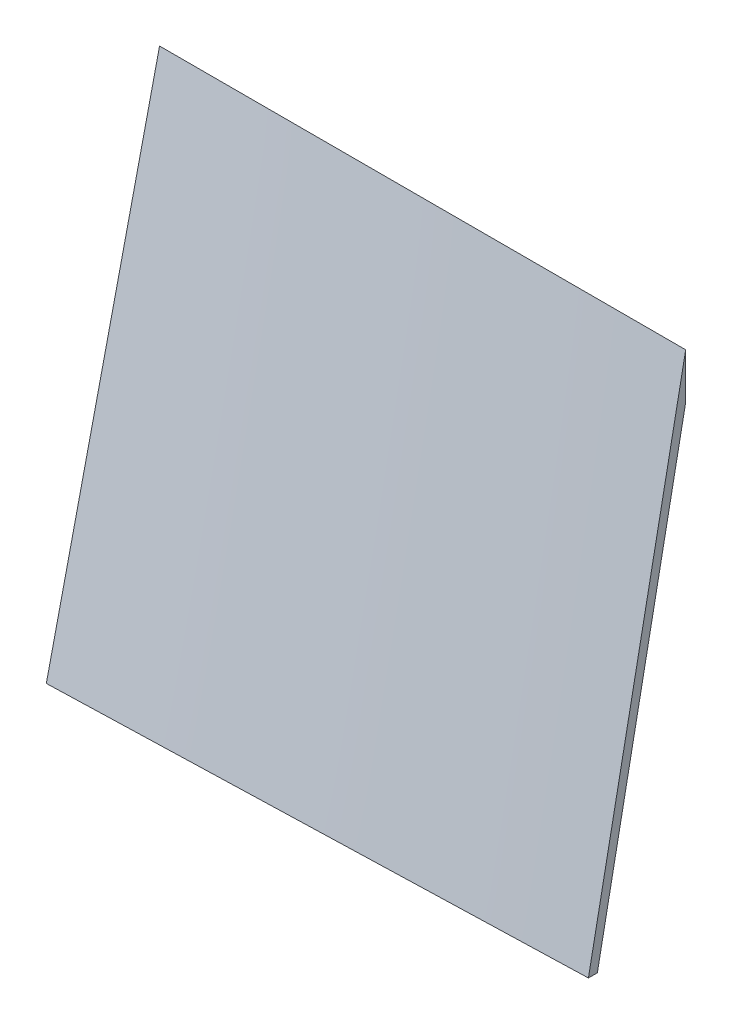
ISO-10303-21;
HEADER;
FILE_DESCRIPTION(('STEP AP214'),'2;1');
FILE_NAME('part.step','',(''),(''),'','','');
FILE_SCHEMA(('AUTOMOTIVE_DESIGN { 1 0 10303 214 1 1 1 1 }'));
ENDSEC;
DATA;
#1=APPLICATION_CONTEXT('core data for automotive mechanical design processes');
#2=APPLICATION_PROTOCOL_DEFINITION('international standard','automotive_design',2000,#1);
#3=PRODUCT_CONTEXT('',#1,'mechanical');
#4=PRODUCT('Part','Part','',(#3));
#5=PRODUCT_RELATED_PRODUCT_CATEGORY('part','',(#4));
#6=PRODUCT_DEFINITION_FORMATION('','',#4);
#7=PRODUCT_DEFINITION_CONTEXT('part definition',#1,'design');
#8=PRODUCT_DEFINITION('design','',#6,#7);
#9=PRODUCT_DEFINITION_SHAPE('','',#8);
#10=(LENGTH_UNIT() NAMED_UNIT(*) SI_UNIT(.MILLI.,.METRE.));
#11=(NAMED_UNIT(*) PLANE_ANGLE_UNIT() SI_UNIT($,.RADIAN.));
#12=(NAMED_UNIT(*) SI_UNIT($,.STERADIAN.) SOLID_ANGLE_UNIT());
#13=UNCERTAINTY_MEASURE_WITH_UNIT(LENGTH_MEASURE(1.E-05),#10,'distance_accuracy_value','');
#14=(GEOMETRIC_REPRESENTATION_CONTEXT(3) GLOBAL_UNCERTAINTY_ASSIGNED_CONTEXT((#13)) GLOBAL_UNIT_ASSIGNED_CONTEXT((#10,
#11,#12)) REPRESENTATION_CONTEXT('',''));
#15=CARTESIAN_POINT('',(0.,0.,0.));
#16=DIRECTION('',(0.,0.,1.));
#17=DIRECTION('',(1.,0.,0.));
#18=AXIS2_PLACEMENT_3D('',#15,#16,#17);
#19=CARTESIAN_POINT('',(600.,0.,0.));
#20=DIRECTION('',(1.,0.,0.));
#21=DIRECTION('',(0.,0.,-1.));
#22=AXIS2_PLACEMENT_3D('',#19,#20,#21);
#23=PLANE('',#22);
#24=DIRECTION('',(0.,0.,-1.));
#25=VECTOR('',#24,1.);
#26=CARTESIAN_POINT('',(600.,0.,110.92));
#27=LINE('',#26,#25);
#28=CARTESIAN_POINT('',(600.,0.,110.92));
#29=VERTEX_POINT('',#28);
#30=CARTESIAN_POINT('',(600.,0.,100.729116885904));
#31=VERTEX_POINT('',#30);
#32=EDGE_CURVE('E123',#29,#31,#27,.T.);
#33=ORIENTED_EDGE('',*,*,#32,.T.);
#34=DIRECTION('',(0.,0.981269227410581,-0.192641385317489));
#35=VECTOR('',#34,1.);
#36=CARTESIAN_POINT('',(600.,0.,100.729116885904));
#37=LINE('',#36,#35);
#38=CARTESIAN_POINT('',(600.,513.090074292608,0.));
#39=VERTEX_POINT('',#38);
#40=EDGE_CURVE('E119',#31,#39,#37,.T.);
#41=ORIENTED_EDGE('',*,*,#40,.T.);
#42=DIRECTION('',(0.,1.,0.));
#43=VECTOR('',#42,1.);
#44=CARTESIAN_POINT('',(600.,513.090074292608,0.));
#45=LINE('',#44,#43);
#46=CARTESIAN_POINT('',(600.,565.,0.));
#47=VERTEX_POINT('',#46);
#48=EDGE_CURVE('E55',#39,#47,#45,.T.);
#49=ORIENTED_EDGE('',*,*,#48,.T.);
#50=DIRECTION('',(0.,-0.981269227410581,0.19264138531749));
#51=VECTOR('',#50,1.);
#52=CARTESIAN_POINT('',(600.,565.,0.));
#53=LINE('',#52,#51);
#54=EDGE_CURVE('E12',#47,#29,#53,.T.);
#55=ORIENTED_EDGE('',*,*,#54,.T.);
#56=EDGE_LOOP('',(#33,#41,#49,#55));
#57=FACE_BOUND('',#56,.T.);
#58=ADVANCED_FACE('F45',(#57),#23,.T.);
#59=CARTESIAN_POINT('',(0.,0.,0.));
#60=DIRECTION('',(1.,0.,0.));
#61=DIRECTION('',(0.,0.,-1.));
#62=AXIS2_PLACEMENT_3D('',#59,#60,#61);
#63=PLANE('',#62);
#64=DIRECTION('',(0.,0.,-1.));
#65=VECTOR('',#64,1.);
#66=CARTESIAN_POINT('',(0.,0.,129.13));
#67=LINE('',#66,#65);
#68=CARTESIAN_POINT('',(0.,0.,129.13));
#69=VERTEX_POINT('',#68);
#70=CARTESIAN_POINT('',(0.,0.,118.872151805901));
#71=VERTEX_POINT('',#70);
#72=EDGE_CURVE('E94',#69,#71,#67,.T.);
#73=ORIENTED_EDGE('',*,*,#72,.F.);
#74=DIRECTION('',(0.,-0.9748633252101,0.222803718910407));
#75=VECTOR('',#74,1.);
#76=CARTESIAN_POINT('',(0.,565.,0.));
#77=LINE('',#76,#75);
#78=CARTESIAN_POINT('',(0.,565.,0.));
#79=VERTEX_POINT('',#78);
#80=EDGE_CURVE('E175',#79,#69,#77,.T.);
#81=ORIENTED_EDGE('',*,*,#80,.F.);
#82=DIRECTION('',(0.,1.,0.));
#83=VECTOR('',#82,1.);
#84=CARTESIAN_POINT('',(0.,520.117445754929,0.));
#85=LINE('',#84,#83);
#86=CARTESIAN_POINT('',(0.,520.117445754929,0.));
#87=VERTEX_POINT('',#86);
#88=EDGE_CURVE('E96',#87,#79,#85,.T.);
#89=ORIENTED_EDGE('',*,*,#88,.F.);
#90=DIRECTION('',(0.,0.974863325210099,-0.222803718910407));
#91=VECTOR('',#90,1.);
#92=CARTESIAN_POINT('',(0.,0.,118.872151805901));
#93=LINE('',#92,#91);
#94=EDGE_CURVE('E90',#71,#87,#93,.T.);
#95=ORIENTED_EDGE('',*,*,#94,.F.);
#96=EDGE_LOOP('',(#73,#81,#89,#95));
#97=FACE_BOUND('',#96,.T.);
#98=ADVANCED_FACE('F93',(#97),#63,.F.);
#99=CARTESIAN_POINT('',(0.,565.,0.));
#100=CARTESIAN_POINT('',(600.,565.,0.));
#101=CARTESIAN_POINT('',(0.,470.833333333333,21.5216666666668));
#102=CARTESIAN_POINT('',(600.,470.833333333328,18.4866666666676));
#103=CARTESIAN_POINT('',(0.,376.666666666666,43.0433333333335));
#104=CARTESIAN_POINT('',(600.,376.666666666659,36.9733333333348));
#105=CARTESIAN_POINT('',(0.,188.333333333332,86.0866666666668));
#106=CARTESIAN_POINT('',(600.,188.333333333326,73.9466666666681));
#107=CARTESIAN_POINT('',(0.,94.1666666666661,107.608333333333));
#108=CARTESIAN_POINT('',(600.,94.1666666666617,92.4333333333343));
#109=CARTESIAN_POINT('',(0.,0.,129.13));
#110=CARTESIAN_POINT('',(600.,0.,110.92));
#111=B_SPLINE_SURFACE_WITH_KNOTS('',3,1,((#99,#100),(#101,#102),(#103,#104),(#105,#106),(#107,
#108),(#109,#110)),.UNSPECIFIED.,.F.,.F.,.F.,(4,2,4),(2,2),(0.,0.5,1.),(0.,1.),.UNSPECIFIED.);
#112=DIRECTION('',(0.999539756680962,0.,-0.0303360316152672));
#113=VECTOR('',#112,1.);
#114=CARTESIAN_POINT('',(300.,0.,120.025));
#115=LINE('',#114,#113);
#116=EDGE_CURVE('E112',#69,#29,#115,.T.);
#117=DIRECTION('',(-1.,0.,0.));
#118=VECTOR('',#117,1.);
#119=CARTESIAN_POINT('',(300.,565.,0.));
#120=LINE('',#119,#118);
#121=EDGE_CURVE('E70',#47,#79,#120,.T.);
#122=ORIENTED_EDGE('',*,*,#80,.T.);
#123=ORIENTED_EDGE('',*,*,#116,.T.);
#124=ORIENTED_EDGE('',*,*,#54,.F.);
#125=ORIENTED_EDGE('',*,*,#121,.T.);
#126=EDGE_LOOP('',(#122,#123,#124,#125));
#127=FACE_BOUND('',#126,.T.);
#128=ADVANCED_FACE('F193',(#127),#111,.T.);
#129=CARTESIAN_POINT('',(0.,0.,0.));
#130=DIRECTION('',(0.,1.,0.));
#131=DIRECTION('',(0.,0.,1.));
#132=AXIS2_PLACEMENT_3D('',#129,#130,#131);
#133=PLANE('',#132);
#134=DIRECTION('',(0.999543133120587,0.,-0.0302245766137488));
#135=VECTOR('',#134,1.);
#136=CARTESIAN_POINT('',(0.,0.,118.872151805901));
#137=LINE('',#136,#135);
#138=EDGE_CURVE('E110',#71,#31,#137,.T.);
#139=ORIENTED_EDGE('',*,*,#138,.T.);
#140=ORIENTED_EDGE('',*,*,#32,.F.);
#141=ORIENTED_EDGE('',*,*,#116,.F.);
#142=ORIENTED_EDGE('',*,*,#72,.T.);
#143=EDGE_LOOP('',(#139,#140,#141,#142));
#144=FACE_BOUND('',#143,.T.);
#145=ADVANCED_FACE('F109',(#144),#133,.F.);
#146=CARTESIAN_POINT('',(0.,0.,0.));
#147=DIRECTION('',(0.,0.,1.));
#148=DIRECTION('',(0.,-1.,0.));
#149=AXIS2_PLACEMENT_3D('',#146,#147,#148);
#150=PLANE('',#149);
#151=ORIENTED_EDGE('',*,*,#121,.F.);
#152=ORIENTED_EDGE('',*,*,#48,.F.);
#153=DIRECTION('',(0.999931418236847,-0.011711482521326,0.));
#154=VECTOR('',#153,1.);
#155=CARTESIAN_POINT('',(300.,516.603760023768,0.));
#156=LINE('',#155,#154);
#157=EDGE_CURVE('E121',#87,#39,#156,.T.);
#158=ORIENTED_EDGE('',*,*,#157,.F.);
#159=ORIENTED_EDGE('',*,*,#88,.T.);
#160=EDGE_LOOP('',(#151,#152,#158,#159));
#161=FACE_BOUND('',#160,.T.);
#162=ADVANCED_FACE('F145',(#161),#150,.F.);
#163=CARTESIAN_POINT('',(0.,0.,118.872151805901));
#164=CARTESIAN_POINT('',(600.,0.,100.729116885904));
#165=CARTESIAN_POINT('',(0.,86.6862409591555,99.0601265049171));
#166=CARTESIAN_POINT('',(600.,85.5150123821019,83.9409307382536));
#167=CARTESIAN_POINT('',(0.,173.372481918311,79.2481012039336));
#168=CARTESIAN_POINT('',(600.,171.030024764204,67.1527445906028));
#169=CARTESIAN_POINT('',(0.,346.74496383662,39.6240506019667));
#170=CARTESIAN_POINT('',(600.,342.060049528406,33.5763722953013));
#171=CARTESIAN_POINT('',(0.,433.431204795775,19.8120253009833));
#172=CARTESIAN_POINT('',(600.,427.575061910507,16.7881861476506));
#173=CARTESIAN_POINT('',(0.,520.117445754929,0.));
#174=CARTESIAN_POINT('',(600.,513.090074292608,0.));
#175=B_SPLINE_SURFACE_WITH_KNOTS('',3,1,((#163,#164),(#165,#166),(#167,#168),(#169,#170),(#171,
#172),(#173,#174)),.UNSPECIFIED.,.F.,.F.,.F.,(4,2,4),(2,2),(0.,0.5,1.),(0.,1.),.UNSPECIFIED.);
#176=ORIENTED_EDGE('',*,*,#94,.T.);
#177=ORIENTED_EDGE('',*,*,#157,.T.);
#178=ORIENTED_EDGE('',*,*,#40,.F.);
#179=ORIENTED_EDGE('',*,*,#138,.F.);
#180=EDGE_LOOP('',(#176,#177,#178,#179));
#181=FACE_BOUND('',#180,.T.);
#182=ADVANCED_FACE('F117',(#181),#175,.T.);
#183=CLOSED_SHELL('',(#58,#98,#128,#145,#162,#182));
#184=MANIFOLD_SOLID_BREP('B2',#183);
#185=ADVANCED_BREP_SHAPE_REPRESENTATION('',(#18,#184),#14);
#186=SHAPE_DEFINITION_REPRESENTATION(#9,#185);
ENDSEC;
END-ISO-10303-21;
